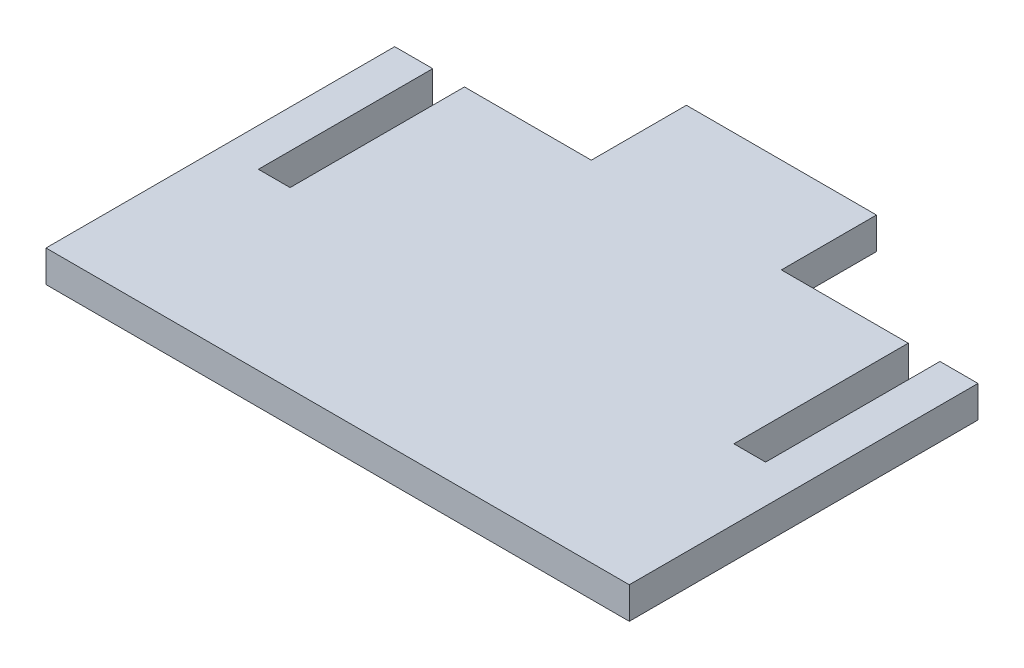
ISO-10303-21;
HEADER;
FILE_DESCRIPTION(('STEP AP214'),'2;1');
FILE_NAME('part.step','',(''),(''),'','','');
FILE_SCHEMA(('AUTOMOTIVE_DESIGN { 1 0 10303 214 1 1 1 1 }'));
ENDSEC;
DATA;
#1=APPLICATION_CONTEXT('core data for automotive mechanical design processes');
#2=APPLICATION_PROTOCOL_DEFINITION('international standard','automotive_design',2000,#1);
#3=PRODUCT_CONTEXT('',#1,'mechanical');
#4=PRODUCT('Part','Part','',(#3));
#5=PRODUCT_RELATED_PRODUCT_CATEGORY('part','',(#4));
#6=PRODUCT_DEFINITION_FORMATION('','',#4);
#7=PRODUCT_DEFINITION_CONTEXT('part definition',#1,'design');
#8=PRODUCT_DEFINITION('design','',#6,#7);
#9=PRODUCT_DEFINITION_SHAPE('','',#8);
#10=(LENGTH_UNIT() NAMED_UNIT(*) SI_UNIT(.MILLI.,.METRE.));
#11=(NAMED_UNIT(*) PLANE_ANGLE_UNIT() SI_UNIT($,.RADIAN.));
#12=(NAMED_UNIT(*) SI_UNIT($,.STERADIAN.) SOLID_ANGLE_UNIT());
#13=UNCERTAINTY_MEASURE_WITH_UNIT(LENGTH_MEASURE(1.E-05),#10,'distance_accuracy_value','');
#14=(GEOMETRIC_REPRESENTATION_CONTEXT(3) GLOBAL_UNCERTAINTY_ASSIGNED_CONTEXT((#13)) GLOBAL_UNIT_ASSIGNED_CONTEXT((#10,
#11,#12)) REPRESENTATION_CONTEXT('',''));
#15=CARTESIAN_POINT('',(0.,0.,0.));
#16=DIRECTION('',(0.,0.,1.));
#17=DIRECTION('',(1.,0.,0.));
#18=AXIS2_PLACEMENT_3D('',#15,#16,#17);
#19=CARTESIAN_POINT('',(-46.,2.5,-27.5));
#20=DIRECTION('',(0.,0.,1.));
#21=DIRECTION('',(1.,0.,0.));
#22=AXIS2_PLACEMENT_3D('',#19,#20,#21);
#23=PLANE('',#22);
#24=DIRECTION('',(-1.,0.,0.));
#25=VECTOR('',#24,1.);
#26=CARTESIAN_POINT('',(-46.,-2.5,-27.5));
#27=LINE('',#26,#25);
#28=CARTESIAN_POINT('',(35.,-2.5,-27.5));
#29=VERTEX_POINT('',#28);
#30=CARTESIAN_POINT('',(14.99,-2.5,-27.5));
#31=VERTEX_POINT('',#30);
#32=EDGE_CURVE('E258',#29,#31,#27,.T.);
#33=ORIENTED_EDGE('',*,*,#32,.T.);
#34=DIRECTION('',(0.,1.,0.));
#35=VECTOR('',#34,1.);
#36=CARTESIAN_POINT('',(14.99,-2.5,-27.5));
#37=LINE('',#36,#35);
#38=CARTESIAN_POINT('',(14.99,2.5,-27.5));
#39=VERTEX_POINT('',#38);
#40=EDGE_CURVE('E56',#31,#39,#37,.T.);
#41=ORIENTED_EDGE('',*,*,#40,.T.);
#42=DIRECTION('',(-1.,0.,0.));
#43=VECTOR('',#42,1.);
#44=CARTESIAN_POINT('',(-46.,2.5,-27.5));
#45=LINE('',#44,#43);
#46=CARTESIAN_POINT('',(35.,2.5,-27.5));
#47=VERTEX_POINT('',#46);
#48=EDGE_CURVE('E246',#47,#39,#45,.T.);
#49=ORIENTED_EDGE('',*,*,#48,.F.);
#50=DIRECTION('',(0.,1.,0.));
#51=VECTOR('',#50,1.);
#52=CARTESIAN_POINT('',(35.,-2.5,-27.5));
#53=LINE('',#52,#51);
#54=EDGE_CURVE('E200',#29,#47,#53,.T.);
#55=ORIENTED_EDGE('',*,*,#54,.F.);
#56=EDGE_LOOP('',(#33,#41,#49,#55));
#57=FACE_BOUND('',#56,.T.);
#58=ADVANCED_FACE('F33',(#57),#23,.F.);
#59=CARTESIAN_POINT('',(-40.,2.5,-27.5));
#60=VERTEX_POINT('',#59);
#61=CARTESIAN_POINT('',(-46.,2.5,-27.5));
#62=VERTEX_POINT('',#61);
#63=EDGE_CURVE('E240',#60,#62,#45,.T.);
#64=ORIENTED_EDGE('',*,*,#63,.F.);
#65=DIRECTION('',(0.,1.,0.));
#66=VECTOR('',#65,1.);
#67=CARTESIAN_POINT('',(-40.,-2.5,-27.5));
#68=LINE('',#67,#66);
#69=CARTESIAN_POINT('',(-40.,-2.5,-27.5));
#70=VERTEX_POINT('',#69);
#71=EDGE_CURVE('E205',#70,#60,#68,.T.);
#72=ORIENTED_EDGE('',*,*,#71,.F.);
#73=CARTESIAN_POINT('',(-46.,-2.5,-27.5));
#74=VERTEX_POINT('',#73);
#75=EDGE_CURVE('E253',#70,#74,#27,.T.);
#76=ORIENTED_EDGE('',*,*,#75,.T.);
#77=DIRECTION('',(0.,-1.,0.));
#78=VECTOR('',#77,1.);
#79=CARTESIAN_POINT('',(-46.,2.5,-27.5));
#80=LINE('',#79,#78);
#81=EDGE_CURVE('E41',#62,#74,#80,.T.);
#82=ORIENTED_EDGE('',*,*,#81,.F.);
#83=EDGE_LOOP('',(#64,#72,#76,#82));
#84=FACE_BOUND('',#83,.T.);
#85=ADVANCED_FACE('F294',(#84),#23,.F.);
#86=CARTESIAN_POINT('',(-14.99,2.5,-27.5));
#87=VERTEX_POINT('',#86);
#88=CARTESIAN_POINT('',(-35.,2.5,-27.5));
#89=VERTEX_POINT('',#88);
#90=EDGE_CURVE('E48',#87,#89,#45,.T.);
#91=ORIENTED_EDGE('',*,*,#90,.F.);
#92=DIRECTION('',(0.,1.,0.));
#93=VECTOR('',#92,1.);
#94=CARTESIAN_POINT('',(-14.99,-2.5,-27.5));
#95=LINE('',#94,#93);
#96=CARTESIAN_POINT('',(-14.99,-2.5,-27.5));
#97=VERTEX_POINT('',#96);
#98=EDGE_CURVE('E182',#97,#87,#95,.T.);
#99=ORIENTED_EDGE('',*,*,#98,.F.);
#100=CARTESIAN_POINT('',(-35.,-2.5,-27.5));
#101=VERTEX_POINT('',#100);
#102=EDGE_CURVE('E259',#97,#101,#27,.T.);
#103=ORIENTED_EDGE('',*,*,#102,.T.);
#104=DIRECTION('',(0.,1.,0.));
#105=VECTOR('',#104,1.);
#106=CARTESIAN_POINT('',(-35.,-2.5,-27.5));
#107=LINE('',#106,#105);
#108=EDGE_CURVE('E208',#101,#89,#107,.T.);
#109=ORIENTED_EDGE('',*,*,#108,.T.);
#110=EDGE_LOOP('',(#91,#99,#103,#109));
#111=FACE_BOUND('',#110,.T.);
#112=ADVANCED_FACE('F305',(#111),#23,.F.);
#113=CARTESIAN_POINT('',(46.,2.5,-27.5));
#114=DIRECTION('',(-1.,0.,0.));
#115=DIRECTION('',(0.,0.,1.));
#116=AXIS2_PLACEMENT_3D('',#113,#114,#115);
#117=PLANE('',#116);
#118=DIRECTION('',(0.,0.,-1.));
#119=VECTOR('',#118,1.);
#120=CARTESIAN_POINT('',(46.,-2.5,-27.5));
#121=LINE('',#120,#119);
#122=CARTESIAN_POINT('',(46.,-2.5,27.5));
#123=VERTEX_POINT('',#122);
#124=CARTESIAN_POINT('',(46.,-2.5,-27.5));
#125=VERTEX_POINT('',#124);
#126=EDGE_CURVE('E207',#123,#125,#121,.T.);
#127=ORIENTED_EDGE('',*,*,#126,.T.);
#128=DIRECTION('',(0.,-1.,0.));
#129=VECTOR('',#128,1.);
#130=CARTESIAN_POINT('',(46.,2.5,-27.5));
#131=LINE('',#130,#129);
#132=CARTESIAN_POINT('',(46.,2.5,-27.5));
#133=VERTEX_POINT('',#132);
#134=EDGE_CURVE('E11',#133,#125,#131,.T.);
#135=ORIENTED_EDGE('',*,*,#134,.F.);
#136=DIRECTION('',(0.,0.,-1.));
#137=VECTOR('',#136,1.);
#138=CARTESIAN_POINT('',(46.,2.5,-27.5));
#139=LINE('',#138,#137);
#140=CARTESIAN_POINT('',(46.,2.5,27.5));
#141=VERTEX_POINT('',#140);
#142=EDGE_CURVE('E237',#141,#133,#139,.T.);
#143=ORIENTED_EDGE('',*,*,#142,.F.);
#144=DIRECTION('',(0.,-1.,0.));
#145=VECTOR('',#144,1.);
#146=CARTESIAN_POINT('',(46.,2.5,27.5));
#147=LINE('',#146,#145);
#148=EDGE_CURVE('E250',#141,#123,#147,.T.);
#149=ORIENTED_EDGE('',*,*,#148,.T.);
#150=EDGE_LOOP('',(#127,#135,#143,#149));
#151=FACE_BOUND('',#150,.T.);
#152=ADVANCED_FACE('F35',(#151),#117,.F.);
#153=CARTESIAN_POINT('',(40.,-2.5,-27.5));
#154=VERTEX_POINT('',#153);
#155=EDGE_CURVE('E254',#125,#154,#27,.T.);
#156=ORIENTED_EDGE('',*,*,#155,.T.);
#157=DIRECTION('',(0.,1.,0.));
#158=VECTOR('',#157,1.);
#159=CARTESIAN_POINT('',(40.,-2.5,-27.5));
#160=LINE('',#159,#158);
#161=CARTESIAN_POINT('',(40.,2.5,-27.5));
#162=VERTEX_POINT('',#161);
#163=EDGE_CURVE('E231',#154,#162,#160,.T.);
#164=ORIENTED_EDGE('',*,*,#163,.T.);
#165=EDGE_CURVE('E242',#133,#162,#45,.T.);
#166=ORIENTED_EDGE('',*,*,#165,.F.);
#167=ORIENTED_EDGE('',*,*,#134,.T.);
#168=EDGE_LOOP('',(#156,#164,#166,#167));
#169=FACE_BOUND('',#168,.T.);
#170=ADVANCED_FACE('F318',(#169),#23,.F.);
#171=CARTESIAN_POINT('',(-46.,2.5,-27.5));
#172=DIRECTION('',(1.,0.,0.));
#173=DIRECTION('',(0.,0.,-1.));
#174=AXIS2_PLACEMENT_3D('',#171,#172,#173);
#175=PLANE('',#174);
#176=DIRECTION('',(0.,0.,1.));
#177=VECTOR('',#176,1.);
#178=CARTESIAN_POINT('',(-46.,-2.5,-27.5));
#179=LINE('',#178,#177);
#180=CARTESIAN_POINT('',(-46.,-2.5,27.5));
#181=VERTEX_POINT('',#180);
#182=EDGE_CURVE('E257',#74,#181,#179,.T.);
#183=ORIENTED_EDGE('',*,*,#182,.T.);
#184=DIRECTION('',(0.,-1.,0.));
#185=VECTOR('',#184,1.);
#186=CARTESIAN_POINT('',(-46.,2.5,27.5));
#187=LINE('',#186,#185);
#188=CARTESIAN_POINT('',(-46.,2.5,27.5));
#189=VERTEX_POINT('',#188);
#190=EDGE_CURVE('E264',#189,#181,#187,.T.);
#191=ORIENTED_EDGE('',*,*,#190,.F.);
#192=DIRECTION('',(0.,0.,1.));
#193=VECTOR('',#192,1.);
#194=CARTESIAN_POINT('',(-46.,2.5,-27.5));
#195=LINE('',#194,#193);
#196=EDGE_CURVE('E245',#62,#189,#195,.T.);
#197=ORIENTED_EDGE('',*,*,#196,.F.);
#198=ORIENTED_EDGE('',*,*,#81,.T.);
#199=EDGE_LOOP('',(#183,#191,#197,#198));
#200=FACE_BOUND('',#199,.T.);
#201=ADVANCED_FACE('F271',(#200),#175,.F.);
#202=CARTESIAN_POINT('',(-46.,2.5,27.5));
#203=DIRECTION('',(0.,0.,-1.));
#204=DIRECTION('',(-1.,0.,0.));
#205=AXIS2_PLACEMENT_3D('',#202,#203,#204);
#206=PLANE('',#205);
#207=DIRECTION('',(1.,0.,0.));
#208=VECTOR('',#207,1.);
#209=CARTESIAN_POINT('',(-46.,-2.5,27.5));
#210=LINE('',#209,#208);
#211=EDGE_CURVE('E241',#181,#123,#210,.T.);
#212=ORIENTED_EDGE('',*,*,#211,.T.);
#213=ORIENTED_EDGE('',*,*,#148,.F.);
#214=DIRECTION('',(1.,0.,0.));
#215=VECTOR('',#214,1.);
#216=CARTESIAN_POINT('',(-46.,2.5,27.5));
#217=LINE('',#216,#215);
#218=EDGE_CURVE('E248',#189,#141,#217,.T.);
#219=ORIENTED_EDGE('',*,*,#218,.F.);
#220=ORIENTED_EDGE('',*,*,#190,.T.);
#221=EDGE_LOOP('',(#212,#213,#219,#220));
#222=FACE_BOUND('',#221,.T.);
#223=ADVANCED_FACE('F279',(#222),#206,.F.);
#224=CARTESIAN_POINT('',(0.,2.5,0.));
#225=DIRECTION('',(0.,1.,0.));
#226=DIRECTION('',(0.,0.,1.));
#227=AXIS2_PLACEMENT_3D('',#224,#225,#226);
#228=PLANE('',#227);
#229=DIRECTION('',(0.,0.,1.));
#230=VECTOR('',#229,1.);
#231=CARTESIAN_POINT('',(-40.,2.5,-27.5));
#232=LINE('',#231,#230);
#233=CARTESIAN_POINT('',(-40.,2.5,0.));
#234=VERTEX_POINT('',#233);
#235=EDGE_CURVE('E196',#60,#234,#232,.T.);
#236=ORIENTED_EDGE('',*,*,#235,.F.);
#237=ORIENTED_EDGE('',*,*,#63,.T.);
#238=ORIENTED_EDGE('',*,*,#196,.T.);
#239=ORIENTED_EDGE('',*,*,#218,.T.);
#240=ORIENTED_EDGE('',*,*,#142,.T.);
#241=ORIENTED_EDGE('',*,*,#165,.T.);
#242=DIRECTION('',(0.,0.,-1.));
#243=VECTOR('',#242,1.);
#244=CARTESIAN_POINT('',(40.,2.5,-27.5));
#245=LINE('',#244,#243);
#246=CARTESIAN_POINT('',(40.,2.5,0.));
#247=VERTEX_POINT('',#246);
#248=EDGE_CURVE('E217',#247,#162,#245,.T.);
#249=ORIENTED_EDGE('',*,*,#248,.F.);
#250=DIRECTION('',(1.,0.,0.));
#251=VECTOR('',#250,1.);
#252=CARTESIAN_POINT('',(35.,2.5,0.));
#253=LINE('',#252,#251);
#254=CARTESIAN_POINT('',(35.,2.5,0.));
#255=VERTEX_POINT('',#254);
#256=EDGE_CURVE('E226',#255,#247,#253,.T.);
#257=ORIENTED_EDGE('',*,*,#256,.F.);
#258=DIRECTION('',(0.,0.,1.));
#259=VECTOR('',#258,1.);
#260=CARTESIAN_POINT('',(35.,2.5,-27.5));
#261=LINE('',#260,#259);
#262=EDGE_CURVE('E181',#47,#255,#261,.T.);
#263=ORIENTED_EDGE('',*,*,#262,.F.);
#264=ORIENTED_EDGE('',*,*,#48,.T.);
#265=DIRECTION('',(0.,0.,-1.));
#266=VECTOR('',#265,1.);
#267=CARTESIAN_POINT('',(14.99,2.5,-42.5));
#268=LINE('',#267,#266);
#269=CARTESIAN_POINT('',(14.99,2.5,-42.5));
#270=VERTEX_POINT('',#269);
#271=EDGE_CURVE('E177',#39,#270,#268,.T.);
#272=ORIENTED_EDGE('',*,*,#271,.T.);
#273=DIRECTION('',(-1.,0.,0.));
#274=VECTOR('',#273,1.);
#275=CARTESIAN_POINT('',(-14.99,2.5,-42.5));
#276=LINE('',#275,#274);
#277=CARTESIAN_POINT('',(-14.99,2.5,-42.5));
#278=VERTEX_POINT('',#277);
#279=EDGE_CURVE('E153',#270,#278,#276,.T.);
#280=ORIENTED_EDGE('',*,*,#279,.T.);
#281=DIRECTION('',(0.,0.,1.));
#282=VECTOR('',#281,1.);
#283=CARTESIAN_POINT('',(-14.99,2.5,-42.5));
#284=LINE('',#283,#282);
#285=EDGE_CURVE('E171',#278,#87,#284,.T.);
#286=ORIENTED_EDGE('',*,*,#285,.T.);
#287=ORIENTED_EDGE('',*,*,#90,.T.);
#288=DIRECTION('',(0.,0.,-1.));
#289=VECTOR('',#288,1.);
#290=CARTESIAN_POINT('',(-35.,2.5,-27.5));
#291=LINE('',#290,#289);
#292=CARTESIAN_POINT('',(-35.,2.5,0.));
#293=VERTEX_POINT('',#292);
#294=EDGE_CURVE('E189',#293,#89,#291,.T.);
#295=ORIENTED_EDGE('',*,*,#294,.F.);
#296=DIRECTION('',(1.,0.,0.));
#297=VECTOR('',#296,1.);
#298=CARTESIAN_POINT('',(-40.,2.5,0.));
#299=LINE('',#298,#297);
#300=EDGE_CURVE('E199',#234,#293,#299,.T.);
#301=ORIENTED_EDGE('',*,*,#300,.F.);
#302=EDGE_LOOP('',(#236,#237,#238,#239,#240,#241,#249,#257,#263,#264,#272,#280,#286,#287,#295,#301));
#303=FACE_BOUND('',#302,.T.);
#304=ADVANCED_FACE('F286',(#303),#228,.T.);
#305=CARTESIAN_POINT('',(0.,-2.5,0.));
#306=DIRECTION('',(0.,1.,0.));
#307=DIRECTION('',(0.,0.,1.));
#308=AXIS2_PLACEMENT_3D('',#305,#306,#307);
#309=PLANE('',#308);
#310=ORIENTED_EDGE('',*,*,#75,.F.);
#311=DIRECTION('',(0.,0.,1.));
#312=VECTOR('',#311,1.);
#313=CARTESIAN_POINT('',(-40.,-2.5,-27.5));
#314=LINE('',#313,#312);
#315=CARTESIAN_POINT('',(-40.,-2.5,0.));
#316=VERTEX_POINT('',#315);
#317=EDGE_CURVE('E185',#70,#316,#314,.T.);
#318=ORIENTED_EDGE('',*,*,#317,.T.);
#319=DIRECTION('',(1.,0.,0.));
#320=VECTOR('',#319,1.);
#321=CARTESIAN_POINT('',(-40.,-2.5,0.));
#322=LINE('',#321,#320);
#323=CARTESIAN_POINT('',(-35.,-2.5,0.));
#324=VERTEX_POINT('',#323);
#325=EDGE_CURVE('E188',#316,#324,#322,.T.);
#326=ORIENTED_EDGE('',*,*,#325,.T.);
#327=DIRECTION('',(0.,0.,-1.));
#328=VECTOR('',#327,1.);
#329=CARTESIAN_POINT('',(-35.,-2.5,-27.5));
#330=LINE('',#329,#328);
#331=EDGE_CURVE('E192',#324,#101,#330,.T.);
#332=ORIENTED_EDGE('',*,*,#331,.T.);
#333=ORIENTED_EDGE('',*,*,#102,.F.);
#334=DIRECTION('',(0.,0.,1.));
#335=VECTOR('',#334,1.);
#336=CARTESIAN_POINT('',(-14.99,-2.5,-42.5));
#337=LINE('',#336,#335);
#338=CARTESIAN_POINT('',(-14.99,-2.5,-42.5));
#339=VERTEX_POINT('',#338);
#340=EDGE_CURVE('E159',#339,#97,#337,.T.);
#341=ORIENTED_EDGE('',*,*,#340,.F.);
#342=DIRECTION('',(-1.,0.,0.));
#343=VECTOR('',#342,1.);
#344=CARTESIAN_POINT('',(-14.99,-2.5,-42.5));
#345=LINE('',#344,#343);
#346=CARTESIAN_POINT('',(14.99,-2.5,-42.5));
#347=VERTEX_POINT('',#346);
#348=EDGE_CURVE('E151',#347,#339,#345,.T.);
#349=ORIENTED_EDGE('',*,*,#348,.F.);
#350=DIRECTION('',(0.,0.,-1.));
#351=VECTOR('',#350,1.);
#352=CARTESIAN_POINT('',(14.99,-2.5,-42.5));
#353=LINE('',#352,#351);
#354=EDGE_CURVE('E167',#31,#347,#353,.T.);
#355=ORIENTED_EDGE('',*,*,#354,.F.);
#356=ORIENTED_EDGE('',*,*,#32,.F.);
#357=DIRECTION('',(0.,0.,1.));
#358=VECTOR('',#357,1.);
#359=CARTESIAN_POINT('',(35.,-2.5,-27.5));
#360=LINE('',#359,#358);
#361=CARTESIAN_POINT('',(35.,-2.5,0.));
#362=VERTEX_POINT('',#361);
#363=EDGE_CURVE('E213',#29,#362,#360,.T.);
#364=ORIENTED_EDGE('',*,*,#363,.T.);
#365=DIRECTION('',(1.,0.,0.));
#366=VECTOR('',#365,1.);
#367=CARTESIAN_POINT('',(35.,-2.5,0.));
#368=LINE('',#367,#366);
#369=CARTESIAN_POINT('',(40.,-2.5,0.));
#370=VERTEX_POINT('',#369);
#371=EDGE_CURVE('E216',#362,#370,#368,.T.);
#372=ORIENTED_EDGE('',*,*,#371,.T.);
#373=DIRECTION('',(0.,0.,-1.));
#374=VECTOR('',#373,1.);
#375=CARTESIAN_POINT('',(40.,-2.5,-27.5));
#376=LINE('',#375,#374);
#377=EDGE_CURVE('E220',#370,#154,#376,.T.);
#378=ORIENTED_EDGE('',*,*,#377,.T.);
#379=ORIENTED_EDGE('',*,*,#155,.F.);
#380=ORIENTED_EDGE('',*,*,#126,.F.);
#381=ORIENTED_EDGE('',*,*,#211,.F.);
#382=ORIENTED_EDGE('',*,*,#182,.F.);
#383=EDGE_LOOP('',(#310,#318,#326,#332,#333,#341,#349,#355,#356,#364,#372,#378,#379,#380,#381,#382));
#384=FACE_BOUND('',#383,.T.);
#385=ADVANCED_FACE('F165',(#384),#309,.F.);
#386=CARTESIAN_POINT('',(35.,-2.5,-27.5));
#387=DIRECTION('',(-1.,0.,0.));
#388=DIRECTION('',(0.,0.,1.));
#389=AXIS2_PLACEMENT_3D('',#386,#387,#388);
#390=PLANE('',#389);
#391=ORIENTED_EDGE('',*,*,#262,.T.);
#392=DIRECTION('',(0.,1.,0.));
#393=VECTOR('',#392,1.);
#394=CARTESIAN_POINT('',(35.,-2.5,0.));
#395=LINE('',#394,#393);
#396=EDGE_CURVE('E223',#362,#255,#395,.T.);
#397=ORIENTED_EDGE('',*,*,#396,.F.);
#398=ORIENTED_EDGE('',*,*,#363,.F.);
#399=ORIENTED_EDGE('',*,*,#54,.T.);
#400=EDGE_LOOP('',(#391,#397,#398,#399));
#401=FACE_BOUND('',#400,.T.);
#402=ADVANCED_FACE('F350',(#401),#390,.F.);
#403=CARTESIAN_POINT('',(40.,-2.5,-27.5));
#404=DIRECTION('',(1.,0.,0.));
#405=DIRECTION('',(0.,0.,-1.));
#406=AXIS2_PLACEMENT_3D('',#403,#404,#405);
#407=PLANE('',#406);
#408=ORIENTED_EDGE('',*,*,#248,.T.);
#409=ORIENTED_EDGE('',*,*,#163,.F.);
#410=ORIENTED_EDGE('',*,*,#377,.F.);
#411=DIRECTION('',(0.,1.,0.));
#412=VECTOR('',#411,1.);
#413=CARTESIAN_POINT('',(40.,-2.5,0.));
#414=LINE('',#413,#412);
#415=EDGE_CURVE('E234',#370,#247,#414,.T.);
#416=ORIENTED_EDGE('',*,*,#415,.T.);
#417=EDGE_LOOP('',(#408,#409,#410,#416));
#418=FACE_BOUND('',#417,.T.);
#419=ADVANCED_FACE('F390',(#418),#407,.F.);
#420=CARTESIAN_POINT('',(35.,-2.5,0.));
#421=DIRECTION('',(0.,0.,1.));
#422=DIRECTION('',(1.,0.,0.));
#423=AXIS2_PLACEMENT_3D('',#420,#421,#422);
#424=PLANE('',#423);
#425=ORIENTED_EDGE('',*,*,#256,.T.);
#426=ORIENTED_EDGE('',*,*,#415,.F.);
#427=ORIENTED_EDGE('',*,*,#371,.F.);
#428=ORIENTED_EDGE('',*,*,#396,.T.);
#429=EDGE_LOOP('',(#425,#426,#427,#428));
#430=FACE_BOUND('',#429,.T.);
#431=ADVANCED_FACE('F398',(#430),#424,.F.);
#432=CARTESIAN_POINT('',(-40.,-2.5,-27.5));
#433=DIRECTION('',(-1.,0.,0.));
#434=DIRECTION('',(0.,0.,1.));
#435=AXIS2_PLACEMENT_3D('',#432,#433,#434);
#436=PLANE('',#435);
#437=ORIENTED_EDGE('',*,*,#235,.T.);
#438=DIRECTION('',(0.,1.,0.));
#439=VECTOR('',#438,1.);
#440=CARTESIAN_POINT('',(-40.,-2.5,0.));
#441=LINE('',#440,#439);
#442=EDGE_CURVE('E195',#316,#234,#441,.T.);
#443=ORIENTED_EDGE('',*,*,#442,.F.);
#444=ORIENTED_EDGE('',*,*,#317,.F.);
#445=ORIENTED_EDGE('',*,*,#71,.T.);
#446=EDGE_LOOP('',(#437,#443,#444,#445));
#447=FACE_BOUND('',#446,.T.);
#448=ADVANCED_FACE('F296',(#447),#436,.F.);
#449=CARTESIAN_POINT('',(-35.,-2.5,-27.5));
#450=DIRECTION('',(1.,0.,0.));
#451=DIRECTION('',(0.,0.,-1.));
#452=AXIS2_PLACEMENT_3D('',#449,#450,#451);
#453=PLANE('',#452);
#454=ORIENTED_EDGE('',*,*,#294,.T.);
#455=ORIENTED_EDGE('',*,*,#108,.F.);
#456=ORIENTED_EDGE('',*,*,#331,.F.);
#457=DIRECTION('',(0.,1.,0.));
#458=VECTOR('',#457,1.);
#459=CARTESIAN_POINT('',(-35.,-2.5,0.));
#460=LINE('',#459,#458);
#461=EDGE_CURVE('E210',#324,#293,#460,.T.);
#462=ORIENTED_EDGE('',*,*,#461,.T.);
#463=EDGE_LOOP('',(#454,#455,#456,#462));
#464=FACE_BOUND('',#463,.T.);
#465=ADVANCED_FACE('F303',(#464),#453,.F.);
#466=CARTESIAN_POINT('',(-40.,-2.5,0.));
#467=DIRECTION('',(0.,0.,1.));
#468=DIRECTION('',(1.,0.,0.));
#469=AXIS2_PLACEMENT_3D('',#466,#467,#468);
#470=PLANE('',#469);
#471=ORIENTED_EDGE('',*,*,#300,.T.);
#472=ORIENTED_EDGE('',*,*,#461,.F.);
#473=ORIENTED_EDGE('',*,*,#325,.F.);
#474=ORIENTED_EDGE('',*,*,#442,.T.);
#475=EDGE_LOOP('',(#471,#472,#473,#474));
#476=FACE_BOUND('',#475,.T.);
#477=ADVANCED_FACE('F300',(#476),#470,.F.);
#478=CARTESIAN_POINT('',(14.99,-2.5,-42.5));
#479=DIRECTION('',(1.,0.,0.));
#480=DIRECTION('',(0.,0.,-1.));
#481=AXIS2_PLACEMENT_3D('',#478,#479,#480);
#482=PLANE('',#481);
#483=ORIENTED_EDGE('',*,*,#271,.F.);
#484=ORIENTED_EDGE('',*,*,#40,.F.);
#485=ORIENTED_EDGE('',*,*,#354,.T.);
#486=DIRECTION('',(0.,1.,0.));
#487=VECTOR('',#486,1.);
#488=CARTESIAN_POINT('',(14.99,-2.5,-42.5));
#489=LINE('',#488,#487);
#490=EDGE_CURVE('E148',#347,#270,#489,.T.);
#491=ORIENTED_EDGE('',*,*,#490,.T.);
#492=EDGE_LOOP('',(#483,#484,#485,#491));
#493=FACE_BOUND('',#492,.T.);
#494=ADVANCED_FACE('F170',(#493),#482,.T.);
#495=CARTESIAN_POINT('',(-14.99,-2.5,-42.5));
#496=DIRECTION('',(-1.,0.,0.));
#497=DIRECTION('',(0.,0.,1.));
#498=AXIS2_PLACEMENT_3D('',#495,#496,#497);
#499=PLANE('',#498);
#500=ORIENTED_EDGE('',*,*,#285,.F.);
#501=DIRECTION('',(0.,1.,0.));
#502=VECTOR('',#501,1.);
#503=CARTESIAN_POINT('',(-14.99,-2.5,-42.5));
#504=LINE('',#503,#502);
#505=EDGE_CURVE('E158',#339,#278,#504,.T.);
#506=ORIENTED_EDGE('',*,*,#505,.F.);
#507=ORIENTED_EDGE('',*,*,#340,.T.);
#508=ORIENTED_EDGE('',*,*,#98,.T.);
#509=EDGE_LOOP('',(#500,#506,#507,#508));
#510=FACE_BOUND('',#509,.T.);
#511=ADVANCED_FACE('F308',(#510),#499,.T.);
#512=CARTESIAN_POINT('',(-14.99,-2.5,-42.5));
#513=DIRECTION('',(0.,0.,-1.));
#514=DIRECTION('',(-1.,0.,0.));
#515=AXIS2_PLACEMENT_3D('',#512,#513,#514);
#516=PLANE('',#515);
#517=ORIENTED_EDGE('',*,*,#279,.F.);
#518=ORIENTED_EDGE('',*,*,#490,.F.);
#519=ORIENTED_EDGE('',*,*,#348,.T.);
#520=ORIENTED_EDGE('',*,*,#505,.T.);
#521=EDGE_LOOP('',(#517,#518,#519,#520));
#522=FACE_BOUND('',#521,.T.);
#523=ADVANCED_FACE('F150',(#522),#516,.T.);
#524=CLOSED_SHELL('',(#58,#85,#112,#152,#170,#201,#223,#304,#385,#402,#419,#431,#448,#465,#477,
#494,#511,#523));
#525=MANIFOLD_SOLID_BREP('B2',#524);
#526=ADVANCED_BREP_SHAPE_REPRESENTATION('',(#18,#525),#14);
#527=SHAPE_DEFINITION_REPRESENTATION(#9,#526);
ENDSEC;
END-ISO-10303-21;
